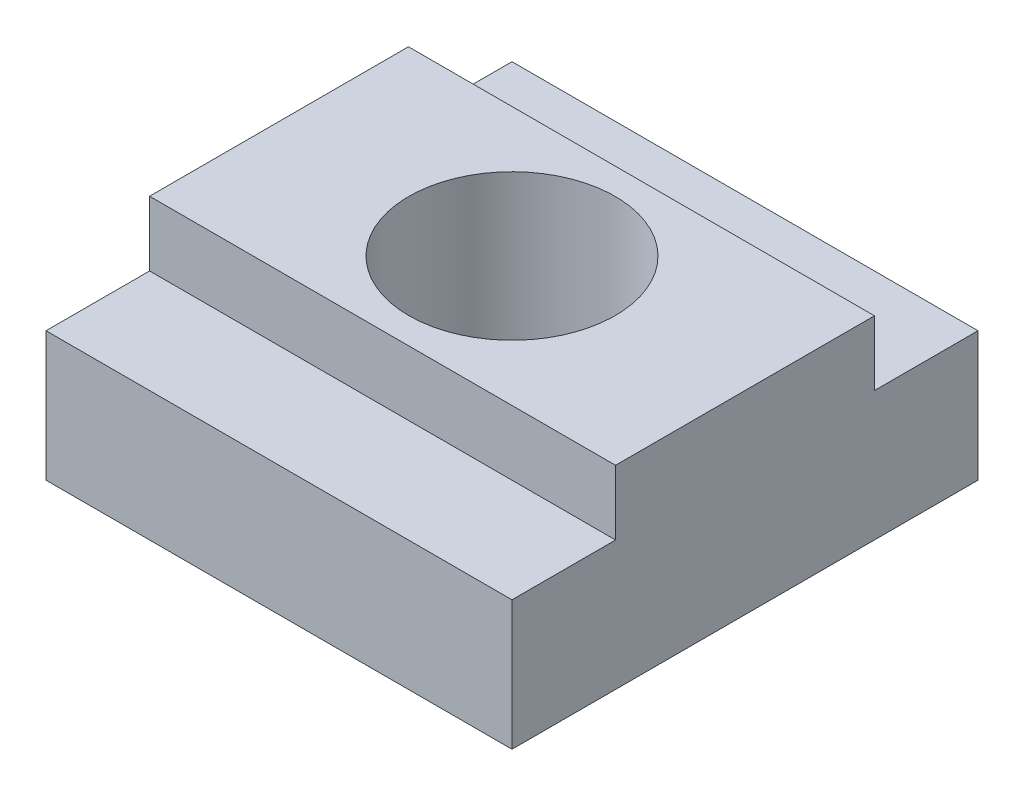
ISO-10303-21;
HEADER;
FILE_DESCRIPTION(('STEP AP214'),'2;1');
FILE_NAME('part.step','',(''),(''),'','','');
FILE_SCHEMA(('AUTOMOTIVE_DESIGN { 1 0 10303 214 1 1 1 1 }'));
ENDSEC;
DATA;
#1=APPLICATION_CONTEXT('core data for automotive mechanical design processes');
#2=APPLICATION_PROTOCOL_DEFINITION('international standard','automotive_design',2000,#1);
#3=PRODUCT_CONTEXT('',#1,'mechanical');
#4=PRODUCT('Part','Part','',(#3));
#5=PRODUCT_RELATED_PRODUCT_CATEGORY('part','',(#4));
#6=PRODUCT_DEFINITION_FORMATION('','',#4);
#7=PRODUCT_DEFINITION_CONTEXT('part definition',#1,'design');
#8=PRODUCT_DEFINITION('design','',#6,#7);
#9=PRODUCT_DEFINITION_SHAPE('','',#8);
#10=(LENGTH_UNIT() NAMED_UNIT(*) SI_UNIT(.MILLI.,.METRE.));
#11=(NAMED_UNIT(*) PLANE_ANGLE_UNIT() SI_UNIT($,.RADIAN.));
#12=(NAMED_UNIT(*) SI_UNIT($,.STERADIAN.) SOLID_ANGLE_UNIT());
#13=UNCERTAINTY_MEASURE_WITH_UNIT(LENGTH_MEASURE(1.E-05),#10,'distance_accuracy_value','');
#14=(GEOMETRIC_REPRESENTATION_CONTEXT(3) GLOBAL_UNCERTAINTY_ASSIGNED_CONTEXT((#13)) GLOBAL_UNIT_ASSIGNED_CONTEXT((#10,
#11,#12)) REPRESENTATION_CONTEXT('',''));
#15=CARTESIAN_POINT('',(0.,0.,0.));
#16=DIRECTION('',(0.,0.,1.));
#17=DIRECTION('',(1.,0.,0.));
#18=AXIS2_PLACEMENT_3D('',#15,#16,#17);
#19=CARTESIAN_POINT('',(-14.2875,11.90625,7.9375));
#20=DIRECTION('',(0.,0.,1.));
#21=DIRECTION('',(1.,0.,0.));
#22=AXIS2_PLACEMENT_3D('',#19,#20,#21);
#23=PLANE('',#22);
#24=DIRECTION('',(0.,-1.,0.));
#25=VECTOR('',#24,1.);
#26=CARTESIAN_POINT('',(14.2875,11.90625,7.9375));
#27=LINE('',#26,#25);
#28=CARTESIAN_POINT('',(14.2875,11.90625,7.9375));
#29=VERTEX_POINT('',#28);
#30=CARTESIAN_POINT('',(14.2875,7.9375,7.9375));
#31=VERTEX_POINT('',#30);
#32=EDGE_CURVE('E130',#29,#31,#27,.T.);
#33=ORIENTED_EDGE('',*,*,#32,.F.);
#34=DIRECTION('',(1.,0.,0.));
#35=VECTOR('',#34,1.);
#36=CARTESIAN_POINT('',(-14.2875,11.90625,7.9375));
#37=LINE('',#36,#35);
#38=CARTESIAN_POINT('',(-14.2875,11.90625,7.9375));
#39=VERTEX_POINT('',#38);
#40=EDGE_CURVE('E11',#39,#29,#37,.T.);
#41=ORIENTED_EDGE('',*,*,#40,.F.);
#42=DIRECTION('',(0.,-1.,0.));
#43=VECTOR('',#42,1.);
#44=CARTESIAN_POINT('',(-14.2875,11.90625,7.9375));
#45=LINE('',#44,#43);
#46=CARTESIAN_POINT('',(-14.2875,7.9375,7.9375));
#47=VERTEX_POINT('',#46);
#48=EDGE_CURVE('E151',#39,#47,#45,.T.);
#49=ORIENTED_EDGE('',*,*,#48,.T.);
#50=DIRECTION('',(1.,0.,0.));
#51=VECTOR('',#50,1.);
#52=CARTESIAN_POINT('',(-14.2875,7.9375,7.9375));
#53=LINE('',#52,#51);
#54=EDGE_CURVE('E36',#47,#31,#53,.T.);
#55=ORIENTED_EDGE('',*,*,#54,.T.);
#56=EDGE_LOOP('',(#33,#41,#49,#55));
#57=FACE_BOUND('',#56,.T.);
#58=ADVANCED_FACE('F33',(#57),#23,.T.);
#59=CARTESIAN_POINT('',(-14.2875,11.90625,-7.9375));
#60=DIRECTION('',(0.,1.,0.));
#61=DIRECTION('',(0.,0.,1.));
#62=AXIS2_PLACEMENT_3D('',#59,#60,#61);
#63=PLANE('',#62);
#64=CARTESIAN_POINT('',(0.,11.90625,0.));
#65=DIRECTION('',(0.,1.,0.));
#66=DIRECTION('',(0.,0.,1.));
#67=AXIS2_PLACEMENT_3D('',#64,#65,#66);
#68=CIRCLE('',#67,6.33095);
#69=CARTESIAN_POINT('',(0.,11.90625,6.33095));
#70=VERTEX_POINT('',#69);
#71=EDGE_CURVE('E206',#70,#70,#68,.T.);
#72=ORIENTED_EDGE('',*,*,#71,.F.);
#73=EDGE_LOOP('',(#72));
#74=FACE_BOUND('',#73,.T.);
#75=DIRECTION('',(0.,0.,1.));
#76=VECTOR('',#75,1.);
#77=CARTESIAN_POINT('',(14.2875,11.90625,-7.9375));
#78=LINE('',#77,#76);
#79=CARTESIAN_POINT('',(14.2875,11.90625,-7.9375));
#80=VERTEX_POINT('',#79);
#81=EDGE_CURVE('E149',#80,#29,#78,.T.);
#82=ORIENTED_EDGE('',*,*,#81,.F.);
#83=DIRECTION('',(1.,0.,0.));
#84=VECTOR('',#83,1.);
#85=CARTESIAN_POINT('',(-14.2875,11.90625,-7.9375));
#86=LINE('',#85,#84);
#87=CARTESIAN_POINT('',(-14.2875,11.90625,-7.9375));
#88=VERTEX_POINT('',#87);
#89=EDGE_CURVE('E42',#88,#80,#86,.T.);
#90=ORIENTED_EDGE('',*,*,#89,.F.);
#91=DIRECTION('',(0.,0.,1.));
#92=VECTOR('',#91,1.);
#93=CARTESIAN_POINT('',(-14.2875,11.90625,-7.9375));
#94=LINE('',#93,#92);
#95=EDGE_CURVE('E120',#88,#39,#94,.T.);
#96=ORIENTED_EDGE('',*,*,#95,.T.);
#97=ORIENTED_EDGE('',*,*,#40,.T.);
#98=EDGE_LOOP('',(#82,#90,#96,#97));
#99=FACE_BOUND('',#98,.T.);
#100=ADVANCED_FACE('F163',(#74,#99),#63,.T.);
#101=CARTESIAN_POINT('',(-14.2875,11.90625,-7.9375));
#102=DIRECTION('',(0.,0.,-1.));
#103=DIRECTION('',(-1.,0.,0.));
#104=AXIS2_PLACEMENT_3D('',#101,#102,#103);
#105=PLANE('',#104);
#106=DIRECTION('',(0.,1.,0.));
#107=VECTOR('',#106,1.);
#108=CARTESIAN_POINT('',(14.2875,11.90625,-7.9375));
#109=LINE('',#108,#107);
#110=CARTESIAN_POINT('',(14.2875,7.9375,-7.9375));
#111=VERTEX_POINT('',#110);
#112=EDGE_CURVE('E107',#111,#80,#109,.T.);
#113=ORIENTED_EDGE('',*,*,#112,.F.);
#114=DIRECTION('',(1.,0.,0.));
#115=VECTOR('',#114,1.);
#116=CARTESIAN_POINT('',(-14.2875,7.9375,-7.9375));
#117=LINE('',#116,#115);
#118=CARTESIAN_POINT('',(-14.2875,7.9375,-7.9375));
#119=VERTEX_POINT('',#118);
#120=EDGE_CURVE('E102',#119,#111,#117,.T.);
#121=ORIENTED_EDGE('',*,*,#120,.F.);
#122=DIRECTION('',(0.,1.,0.));
#123=VECTOR('',#122,1.);
#124=CARTESIAN_POINT('',(-14.2875,11.90625,-7.9375));
#125=LINE('',#124,#123);
#126=EDGE_CURVE('E105',#119,#88,#125,.T.);
#127=ORIENTED_EDGE('',*,*,#126,.T.);
#128=ORIENTED_EDGE('',*,*,#89,.T.);
#129=EDGE_LOOP('',(#113,#121,#127,#128));
#130=FACE_BOUND('',#129,.T.);
#131=ADVANCED_FACE('F104',(#130),#105,.T.);
#132=CARTESIAN_POINT('',(-14.2875,7.9375,-7.9375));
#133=DIRECTION('',(0.,1.,0.));
#134=DIRECTION('',(0.,0.,1.));
#135=AXIS2_PLACEMENT_3D('',#132,#133,#134);
#136=PLANE('',#135);
#137=DIRECTION('',(0.,0.,1.));
#138=VECTOR('',#137,1.);
#139=CARTESIAN_POINT('',(14.2875,7.9375,-7.9375));
#140=LINE('',#139,#138);
#141=CARTESIAN_POINT('',(14.2875,7.9375,-14.2875));
#142=VERTEX_POINT('',#141);
#143=EDGE_CURVE('E146',#142,#111,#140,.T.);
#144=ORIENTED_EDGE('',*,*,#143,.F.);
#145=DIRECTION('',(1.,0.,0.));
#146=VECTOR('',#145,1.);
#147=CARTESIAN_POINT('',(-14.2875,7.9375,-14.2875));
#148=LINE('',#147,#146);
#149=CARTESIAN_POINT('',(-14.2875,7.9375,-14.2875));
#150=VERTEX_POINT('',#149);
#151=EDGE_CURVE('E112',#150,#142,#148,.T.);
#152=ORIENTED_EDGE('',*,*,#151,.F.);
#153=DIRECTION('',(0.,0.,1.));
#154=VECTOR('',#153,1.);
#155=CARTESIAN_POINT('',(-14.2875,7.9375,-7.9375));
#156=LINE('',#155,#154);
#157=EDGE_CURVE('E118',#150,#119,#156,.T.);
#158=ORIENTED_EDGE('',*,*,#157,.T.);
#159=ORIENTED_EDGE('',*,*,#120,.T.);
#160=EDGE_LOOP('',(#144,#152,#158,#159));
#161=FACE_BOUND('',#160,.T.);
#162=ADVANCED_FACE('F122',(#161),#136,.T.);
#163=CARTESIAN_POINT('',(-14.2875,7.9375,-14.2875));
#164=DIRECTION('',(0.,0.,-1.));
#165=DIRECTION('',(0.,1.,0.));
#166=AXIS2_PLACEMENT_3D('',#163,#164,#165);
#167=PLANE('',#166);
#168=DIRECTION('',(0.,1.,0.));
#169=VECTOR('',#168,1.);
#170=CARTESIAN_POINT('',(14.2875,7.9375,-14.2875));
#171=LINE('',#170,#169);
#172=CARTESIAN_POINT('',(14.2875,0.,-14.2875));
#173=VERTEX_POINT('',#172);
#174=EDGE_CURVE('E143',#173,#142,#171,.T.);
#175=ORIENTED_EDGE('',*,*,#174,.F.);
#176=DIRECTION('',(1.,0.,0.));
#177=VECTOR('',#176,1.);
#178=CARTESIAN_POINT('',(-14.2875,0.,-14.2875));
#179=LINE('',#178,#177);
#180=CARTESIAN_POINT('',(-14.2875,0.,-14.2875));
#181=VERTEX_POINT('',#180);
#182=EDGE_CURVE('E155',#181,#173,#179,.T.);
#183=ORIENTED_EDGE('',*,*,#182,.F.);
#184=DIRECTION('',(0.,1.,0.));
#185=VECTOR('',#184,1.);
#186=CARTESIAN_POINT('',(-14.2875,7.9375,-14.2875));
#187=LINE('',#186,#185);
#188=EDGE_CURVE('E123',#181,#150,#187,.T.);
#189=ORIENTED_EDGE('',*,*,#188,.T.);
#190=ORIENTED_EDGE('',*,*,#151,.T.);
#191=EDGE_LOOP('',(#175,#183,#189,#190));
#192=FACE_BOUND('',#191,.T.);
#193=ADVANCED_FACE('F178',(#192),#167,.T.);
#194=CARTESIAN_POINT('',(-14.2875,0.,14.2875));
#195=DIRECTION('',(0.,-1.,0.));
#196=DIRECTION('',(0.,0.,-1.));
#197=AXIS2_PLACEMENT_3D('',#194,#195,#196);
#198=PLANE('',#197);
#199=CARTESIAN_POINT('',(0.,0.,0.));
#200=DIRECTION('',(0.,1.,0.));
#201=DIRECTION('',(0.,0.,1.));
#202=AXIS2_PLACEMENT_3D('',#199,#200,#201);
#203=CIRCLE('',#202,6.33095);
#204=CARTESIAN_POINT('',(0.,0.,6.33095));
#205=VERTEX_POINT('',#204);
#206=EDGE_CURVE('E134',#205,#205,#203,.T.);
#207=ORIENTED_EDGE('',*,*,#206,.T.);
#208=EDGE_LOOP('',(#207));
#209=FACE_BOUND('',#208,.T.);
#210=DIRECTION('',(0.,0.,-1.));
#211=VECTOR('',#210,1.);
#212=CARTESIAN_POINT('',(14.2875,0.,14.2875));
#213=LINE('',#212,#211);
#214=CARTESIAN_POINT('',(14.2875,0.,14.2875));
#215=VERTEX_POINT('',#214);
#216=EDGE_CURVE('E140',#215,#173,#213,.T.);
#217=ORIENTED_EDGE('',*,*,#216,.F.);
#218=DIRECTION('',(1.,0.,0.));
#219=VECTOR('',#218,1.);
#220=CARTESIAN_POINT('',(-14.2875,0.,14.2875));
#221=LINE('',#220,#219);
#222=CARTESIAN_POINT('',(-14.2875,0.,14.2875));
#223=VERTEX_POINT('',#222);
#224=EDGE_CURVE('E157',#223,#215,#221,.T.);
#225=ORIENTED_EDGE('',*,*,#224,.F.);
#226=DIRECTION('',(0.,0.,-1.));
#227=VECTOR('',#226,1.);
#228=CARTESIAN_POINT('',(-14.2875,0.,14.2875));
#229=LINE('',#228,#227);
#230=EDGE_CURVE('E125',#223,#181,#229,.T.);
#231=ORIENTED_EDGE('',*,*,#230,.T.);
#232=ORIENTED_EDGE('',*,*,#182,.T.);
#233=EDGE_LOOP('',(#217,#225,#231,#232));
#234=FACE_BOUND('',#233,.T.);
#235=ADVANCED_FACE('F181',(#209,#234),#198,.T.);
#236=CARTESIAN_POINT('',(-14.2875,7.9375,14.2875));
#237=DIRECTION('',(0.,0.,1.));
#238=DIRECTION('',(0.,-1.,0.));
#239=AXIS2_PLACEMENT_3D('',#236,#237,#238);
#240=PLANE('',#239);
#241=DIRECTION('',(0.,-1.,0.));
#242=VECTOR('',#241,1.);
#243=CARTESIAN_POINT('',(14.2875,7.9375,14.2875));
#244=LINE('',#243,#242);
#245=CARTESIAN_POINT('',(14.2875,7.9375,14.2875));
#246=VERTEX_POINT('',#245);
#247=EDGE_CURVE('E137',#246,#215,#244,.T.);
#248=ORIENTED_EDGE('',*,*,#247,.F.);
#249=DIRECTION('',(1.,0.,0.));
#250=VECTOR('',#249,1.);
#251=CARTESIAN_POINT('',(-14.2875,7.9375,14.2875));
#252=LINE('',#251,#250);
#253=CARTESIAN_POINT('',(-14.2875,7.9375,14.2875));
#254=VERTEX_POINT('',#253);
#255=EDGE_CURVE('E158',#254,#246,#252,.T.);
#256=ORIENTED_EDGE('',*,*,#255,.F.);
#257=DIRECTION('',(0.,-1.,0.));
#258=VECTOR('',#257,1.);
#259=CARTESIAN_POINT('',(-14.2875,7.9375,14.2875));
#260=LINE('',#259,#258);
#261=EDGE_CURVE('E213',#254,#223,#260,.T.);
#262=ORIENTED_EDGE('',*,*,#261,.T.);
#263=ORIENTED_EDGE('',*,*,#224,.T.);
#264=EDGE_LOOP('',(#248,#256,#262,#263));
#265=FACE_BOUND('',#264,.T.);
#266=ADVANCED_FACE('F185',(#265),#240,.T.);
#267=CARTESIAN_POINT('',(-14.2875,7.9375,7.9375));
#268=DIRECTION('',(0.,1.,0.));
#269=DIRECTION('',(0.,0.,1.));
#270=AXIS2_PLACEMENT_3D('',#267,#268,#269);
#271=PLANE('',#270);
#272=DIRECTION('',(0.,0.,1.));
#273=VECTOR('',#272,1.);
#274=CARTESIAN_POINT('',(14.2875,7.9375,7.9375));
#275=LINE('',#274,#273);
#276=EDGE_CURVE('E133',#31,#246,#275,.T.);
#277=ORIENTED_EDGE('',*,*,#276,.F.);
#278=ORIENTED_EDGE('',*,*,#54,.F.);
#279=DIRECTION('',(0.,0.,1.));
#280=VECTOR('',#279,1.);
#281=CARTESIAN_POINT('',(-14.2875,7.9375,7.9375));
#282=LINE('',#281,#280);
#283=EDGE_CURVE('E211',#47,#254,#282,.T.);
#284=ORIENTED_EDGE('',*,*,#283,.T.);
#285=ORIENTED_EDGE('',*,*,#255,.T.);
#286=EDGE_LOOP('',(#277,#278,#284,#285));
#287=FACE_BOUND('',#286,.T.);
#288=ADVANCED_FACE('F160',(#287),#271,.T.);
#289=CARTESIAN_POINT('',(-14.2875,0.,0.));
#290=DIRECTION('',(-1.,0.,0.));
#291=DIRECTION('',(0.,0.,1.));
#292=AXIS2_PLACEMENT_3D('',#289,#290,#291);
#293=PLANE('',#292);
#294=ORIENTED_EDGE('',*,*,#48,.F.);
#295=ORIENTED_EDGE('',*,*,#95,.F.);
#296=ORIENTED_EDGE('',*,*,#126,.F.);
#297=ORIENTED_EDGE('',*,*,#157,.F.);
#298=ORIENTED_EDGE('',*,*,#188,.F.);
#299=ORIENTED_EDGE('',*,*,#230,.F.);
#300=ORIENTED_EDGE('',*,*,#261,.F.);
#301=ORIENTED_EDGE('',*,*,#283,.F.);
#302=EDGE_LOOP('',(#294,#295,#296,#297,#298,#299,#300,#301));
#303=FACE_BOUND('',#302,.T.);
#304=ADVANCED_FACE('F116',(#303),#293,.T.);
#305=CARTESIAN_POINT('',(14.2875,0.,0.));
#306=DIRECTION('',(-1.,0.,0.));
#307=DIRECTION('',(0.,0.,1.));
#308=AXIS2_PLACEMENT_3D('',#305,#306,#307);
#309=PLANE('',#308);
#310=ORIENTED_EDGE('',*,*,#32,.T.);
#311=ORIENTED_EDGE('',*,*,#276,.T.);
#312=ORIENTED_EDGE('',*,*,#247,.T.);
#313=ORIENTED_EDGE('',*,*,#216,.T.);
#314=ORIENTED_EDGE('',*,*,#174,.T.);
#315=ORIENTED_EDGE('',*,*,#143,.T.);
#316=ORIENTED_EDGE('',*,*,#112,.T.);
#317=ORIENTED_EDGE('',*,*,#81,.T.);
#318=EDGE_LOOP('',(#310,#311,#312,#313,#314,#315,#316,#317));
#319=FACE_BOUND('',#318,.T.);
#320=ADVANCED_FACE('F162',(#319),#309,.F.);
#321=CARTESIAN_POINT('',(0.,0.,0.));
#322=DIRECTION('',(0.,1.,0.));
#323=DIRECTION('',(0.,0.,1.));
#324=AXIS2_PLACEMENT_3D('',#321,#322,#323);
#325=CYLINDRICAL_SURFACE('',#324,6.33095);
#326=ORIENTED_EDGE('',*,*,#206,.F.);
#327=EDGE_LOOP('',(#326));
#328=FACE_BOUND('',#327,.T.);
#329=ORIENTED_EDGE('',*,*,#71,.T.);
#330=EDGE_LOOP('',(#329));
#331=FACE_BOUND('',#330,.T.);
#332=ADVANCED_FACE('F196',(#328,#331),#325,.F.);
#333=CLOSED_SHELL('',(#58,#100,#131,#162,#193,#235,#266,#288,#304,#320,#332));
#334=MANIFOLD_SOLID_BREP('B2',#333);
#335=ADVANCED_BREP_SHAPE_REPRESENTATION('',(#18,#334),#14);
#336=SHAPE_DEFINITION_REPRESENTATION(#9,#335);
ENDSEC;
END-ISO-10303-21;
